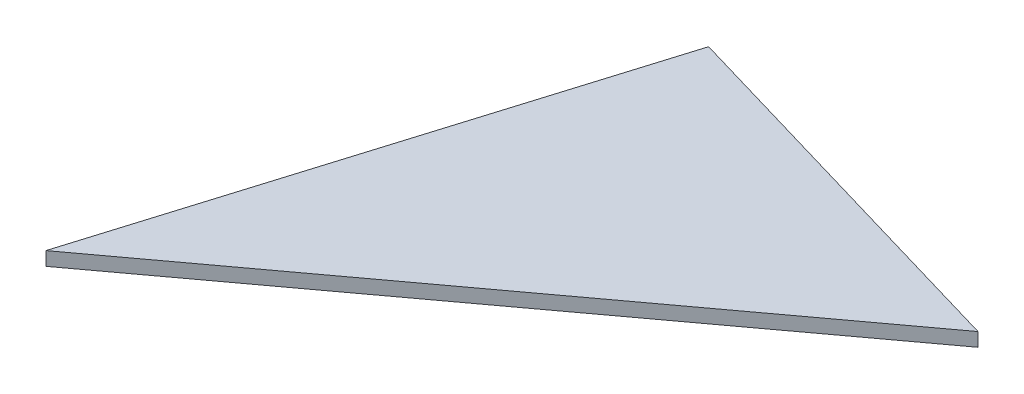
ISO-10303-21;
HEADER;
FILE_DESCRIPTION(('STEP AP214'),'2;1');
FILE_NAME('part.step','',(''),(''),'','','');
FILE_SCHEMA(('AUTOMOTIVE_DESIGN { 1 0 10303 214 1 1 1 1 }'));
ENDSEC;
DATA;
#1=APPLICATION_CONTEXT('core data for automotive mechanical design processes');
#2=APPLICATION_PROTOCOL_DEFINITION('international standard','automotive_design',2000,#1);
#3=PRODUCT_CONTEXT('',#1,'mechanical');
#4=PRODUCT('Part','Part','',(#3));
#5=PRODUCT_RELATED_PRODUCT_CATEGORY('part','',(#4));
#6=PRODUCT_DEFINITION_FORMATION('','',#4);
#7=PRODUCT_DEFINITION_CONTEXT('part definition',#1,'design');
#8=PRODUCT_DEFINITION('design','',#6,#7);
#9=PRODUCT_DEFINITION_SHAPE('','',#8);
#10=(LENGTH_UNIT() NAMED_UNIT(*) SI_UNIT(.MILLI.,.METRE.));
#11=(NAMED_UNIT(*) PLANE_ANGLE_UNIT() SI_UNIT($,.RADIAN.));
#12=(NAMED_UNIT(*) SI_UNIT($,.STERADIAN.) SOLID_ANGLE_UNIT());
#13=UNCERTAINTY_MEASURE_WITH_UNIT(LENGTH_MEASURE(1.E-05),#10,'distance_accuracy_value','');
#14=(GEOMETRIC_REPRESENTATION_CONTEXT(3) GLOBAL_UNCERTAINTY_ASSIGNED_CONTEXT((#13)) GLOBAL_UNIT_ASSIGNED_CONTEXT((#10,
#11,#12)) REPRESENTATION_CONTEXT('',''));
#15=CARTESIAN_POINT('',(0.,0.,0.));
#16=DIRECTION('',(0.,0.,1.));
#17=DIRECTION('',(1.,0.,0.));
#18=AXIS2_PLACEMENT_3D('',#15,#16,#17);
#19=CARTESIAN_POINT('',(78.5427380226673,2.,-58.0022492041875));
#20=DIRECTION('',(-0.281755849416274,0.,0.959486133990332));
#21=DIRECTION('',(0.959486133990332,0.,0.281755849416274));
#22=AXIS2_PLACEMENT_3D('',#19,#20,#21);
#23=PLANE('',#22);
#24=DIRECTION('',(-0.959486133990332,0.,-0.281755849416274));
#25=VECTOR('',#24,1.);
#26=CARTESIAN_POINT('',(78.5427380226673,0.,-58.0022492041875));
#27=LINE('',#26,#25);
#28=CARTESIAN_POINT('',(78.5427380226673,0.,-58.0022492041875));
#29=VERTEX_POINT('',#28);
#30=CARTESIAN_POINT('',(22.6719537863442,0.,-74.4088649043965));
#31=VERTEX_POINT('',#30);
#32=EDGE_CURVE('E89',#29,#31,#27,.T.);
#33=ORIENTED_EDGE('',*,*,#32,.T.);
#34=DIRECTION('',(0.,-1.,0.));
#35=VECTOR('',#34,1.);
#36=CARTESIAN_POINT('',(22.6719537863442,2.,-74.4088649043965));
#37=LINE('',#36,#35);
#38=CARTESIAN_POINT('',(22.6719537863442,2.,-74.4088649043965));
#39=VERTEX_POINT('',#38);
#40=EDGE_CURVE('E11',#39,#31,#37,.T.);
#41=ORIENTED_EDGE('',*,*,#40,.F.);
#42=DIRECTION('',(-0.959486133990332,0.,-0.281755849416274));
#43=VECTOR('',#42,1.);
#44=CARTESIAN_POINT('',(78.5427380226673,2.,-58.0022492041875));
#45=LINE('',#44,#43);
#46=CARTESIAN_POINT('',(78.5427380226673,2.,-58.0022492041875));
#47=VERTEX_POINT('',#46);
#48=EDGE_CURVE('E81',#47,#39,#45,.T.);
#49=ORIENTED_EDGE('',*,*,#48,.F.);
#50=DIRECTION('',(0.,-1.,0.));
#51=VECTOR('',#50,1.);
#52=CARTESIAN_POINT('',(78.5427380226673,2.,-58.0022492041875));
#53=LINE('',#52,#51);
#54=EDGE_CURVE('E90',#47,#29,#53,.T.);
#55=ORIENTED_EDGE('',*,*,#54,.T.);
#56=EDGE_LOOP('',(#33,#41,#49,#55));
#57=FACE_BOUND('',#56,.T.);
#58=ADVANCED_FACE('F39',(#57),#23,.F.);
#59=CARTESIAN_POINT('',(22.6719537863442,2.,-74.4088649043965));
#60=DIRECTION('',(0.95658152499194,0.,0.291464896761333));
#61=DIRECTION('',(0.291464896761333,0.,-0.95658152499194));
#62=AXIS2_PLACEMENT_3D('',#59,#60,#61);
#63=PLANE('',#62);
#64=DIRECTION('',(-0.291464896761333,0.,0.95658152499194));
#65=VECTOR('',#64,1.);
#66=CARTESIAN_POINT('',(22.6719537863442,0.,-74.4088649043965));
#67=LINE('',#66,#65);
#68=CARTESIAN_POINT('',(0.,0.,0.));
#69=VERTEX_POINT('',#68);
#70=EDGE_CURVE('E68',#31,#69,#67,.T.);
#71=ORIENTED_EDGE('',*,*,#70,.T.);
#72=DIRECTION('',(0.,-1.,0.));
#73=VECTOR('',#72,1.);
#74=CARTESIAN_POINT('',(0.,2.,0.));
#75=LINE('',#74,#73);
#76=CARTESIAN_POINT('',(0.,2.,0.));
#77=VERTEX_POINT('',#76);
#78=EDGE_CURVE('E48',#77,#69,#75,.T.);
#79=ORIENTED_EDGE('',*,*,#78,.F.);
#80=DIRECTION('',(-0.291464896761333,0.,0.95658152499194));
#81=VECTOR('',#80,1.);
#82=CARTESIAN_POINT('',(22.6719537863442,2.,-74.4088649043965));
#83=LINE('',#82,#81);
#84=EDGE_CURVE('E76',#39,#77,#83,.T.);
#85=ORIENTED_EDGE('',*,*,#84,.F.);
#86=ORIENTED_EDGE('',*,*,#40,.T.);
#87=EDGE_LOOP('',(#71,#79,#85,#86));
#88=FACE_BOUND('',#87,.T.);
#89=ADVANCED_FACE('F77',(#88),#63,.F.);
#90=CARTESIAN_POINT('',(0.,2.,0.));
#91=DIRECTION('',(-0.5940526913183,0.,-0.804426130814685));
#92=DIRECTION('',(-0.804426130814685,0.,0.5940526913183));
#93=AXIS2_PLACEMENT_3D('',#90,#91,#92);
#94=PLANE('',#93);
#95=DIRECTION('',(0.804426130814685,0.,-0.5940526913183));
#96=VECTOR('',#95,1.);
#97=CARTESIAN_POINT('',(0.,0.,0.));
#98=LINE('',#97,#96);
#99=EDGE_CURVE('E73',#69,#29,#98,.T.);
#100=ORIENTED_EDGE('',*,*,#99,.T.);
#101=ORIENTED_EDGE('',*,*,#54,.F.);
#102=DIRECTION('',(0.804426130814685,0.,-0.5940526913183));
#103=VECTOR('',#102,1.);
#104=CARTESIAN_POINT('',(0.,2.,0.));
#105=LINE('',#104,#103);
#106=EDGE_CURVE('E56',#77,#47,#105,.T.);
#107=ORIENTED_EDGE('',*,*,#106,.F.);
#108=ORIENTED_EDGE('',*,*,#78,.T.);
#109=EDGE_LOOP('',(#100,#101,#107,#108));
#110=FACE_BOUND('',#109,.T.);
#111=ADVANCED_FACE('F102',(#110),#94,.F.);
#112=CARTESIAN_POINT('',(0.,2.,0.));
#113=DIRECTION('',(0.,1.,0.));
#114=DIRECTION('',(0.,0.,1.));
#115=AXIS2_PLACEMENT_3D('',#112,#113,#114);
#116=PLANE('',#115);
#117=ORIENTED_EDGE('',*,*,#48,.T.);
#118=ORIENTED_EDGE('',*,*,#84,.T.);
#119=ORIENTED_EDGE('',*,*,#106,.T.);
#120=EDGE_LOOP('',(#117,#118,#119));
#121=FACE_BOUND('',#120,.T.);
#122=ADVANCED_FACE('F84',(#121),#116,.T.);
#123=CARTESIAN_POINT('',(0.,0.,0.));
#124=DIRECTION('',(0.,1.,0.));
#125=DIRECTION('',(0.,0.,1.));
#126=AXIS2_PLACEMENT_3D('',#123,#124,#125);
#127=PLANE('',#126);
#128=ORIENTED_EDGE('',*,*,#32,.F.);
#129=ORIENTED_EDGE('',*,*,#99,.F.);
#130=ORIENTED_EDGE('',*,*,#70,.F.);
#131=EDGE_LOOP('',(#128,#129,#130));
#132=FACE_BOUND('',#131,.T.);
#133=ADVANCED_FACE('F103',(#132),#127,.F.);
#134=CLOSED_SHELL('',(#58,#89,#111,#122,#133));
#135=MANIFOLD_SOLID_BREP('B2',#134);
#136=ADVANCED_BREP_SHAPE_REPRESENTATION('',(#18,#135),#14);
#137=SHAPE_DEFINITION_REPRESENTATION(#9,#136);
ENDSEC;
END-ISO-10303-21;
